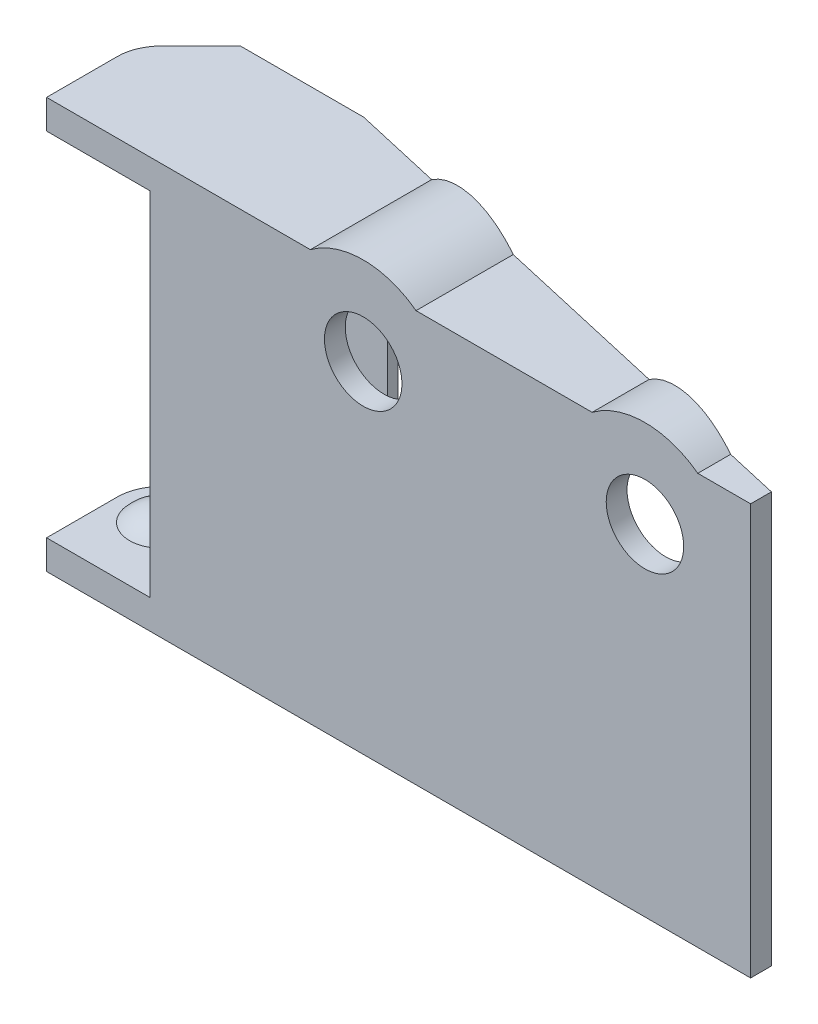
ISO-10303-21;
HEADER;
FILE_DESCRIPTION(('STEP AP214'),'2;1');
FILE_NAME('part.step','',(''),(''),'','','');
FILE_SCHEMA(('AUTOMOTIVE_DESIGN { 1 0 10303 214 1 1 1 1 }'));
ENDSEC;
DATA;
#1=APPLICATION_CONTEXT('core data for automotive mechanical design processes');
#2=APPLICATION_PROTOCOL_DEFINITION('international standard','automotive_design',2000,#1);
#3=PRODUCT_CONTEXT('',#1,'mechanical');
#4=PRODUCT('Part','Part','',(#3));
#5=PRODUCT_RELATED_PRODUCT_CATEGORY('part','',(#4));
#6=PRODUCT_DEFINITION_FORMATION('','',#4);
#7=PRODUCT_DEFINITION_CONTEXT('part definition',#1,'design');
#8=PRODUCT_DEFINITION('design','',#6,#7);
#9=PRODUCT_DEFINITION_SHAPE('','',#8);
#10=(LENGTH_UNIT() NAMED_UNIT(*) SI_UNIT(.MILLI.,.METRE.));
#11=(NAMED_UNIT(*) PLANE_ANGLE_UNIT() SI_UNIT($,.RADIAN.));
#12=(NAMED_UNIT(*) SI_UNIT($,.STERADIAN.) SOLID_ANGLE_UNIT());
#13=UNCERTAINTY_MEASURE_WITH_UNIT(LENGTH_MEASURE(1.E-05),#10,'distance_accuracy_value','');
#14=(GEOMETRIC_REPRESENTATION_CONTEXT(3) GLOBAL_UNCERTAINTY_ASSIGNED_CONTEXT((#13)) GLOBAL_UNIT_ASSIGNED_CONTEXT((#10,
#11,#12)) REPRESENTATION_CONTEXT('',''));
#15=CARTESIAN_POINT('',(0.,0.,0.));
#16=DIRECTION('',(0.,0.,1.));
#17=DIRECTION('',(1.,0.,0.));
#18=AXIS2_PLACEMENT_3D('',#15,#16,#17);
#19=CARTESIAN_POINT('',(-6.35,2.1082,-3.175));
#20=DIRECTION('',(0.,1.,0.));
#21=DIRECTION('',(0.,0.,1.));
#22=AXIS2_PLACEMENT_3D('',#19,#20,#21);
#23=PLANE('',#22);
#24=DIRECTION('',(1.,0.,0.));
#25=VECTOR('',#24,1.);
#26=CARTESIAN_POINT('',(-9.525,2.1082,1.92377963979501));
#27=LINE('',#26,#25);
#28=CARTESIAN_POINT('',(-9.525,2.1082,1.92377963979501));
#29=VERTEX_POINT('',#28);
#30=CARTESIAN_POINT('',(9.4996,2.1082,1.92377963979501));
#31=VERTEX_POINT('',#30);
#32=EDGE_CURVE('E63',#29,#31,#27,.T.);
#33=ORIENTED_EDGE('',*,*,#32,.T.);
#34=DIRECTION('',(0.,0.,1.));
#35=VECTOR('',#34,1.);
#36=CARTESIAN_POINT('',(9.4996,2.1082,-13.778905146089));
#37=LINE('',#36,#35);
#38=CARTESIAN_POINT('',(9.4996,2.1082,-6.82418642653));
#39=VERTEX_POINT('',#38);
#40=EDGE_CURVE('E241',#39,#31,#37,.T.);
#41=ORIENTED_EDGE('',*,*,#40,.F.);
#42=DIRECTION('',(-0.974919679603738,0.,-0.22255700016253));
#43=VECTOR('',#42,1.);
#44=CARTESIAN_POINT('',(3.1496,2.1082,-8.273779639795));
#45=LINE('',#44,#43);
#46=CARTESIAN_POINT('',(3.1496,2.1082,-8.273779639795));
#47=VERTEX_POINT('',#46);
#48=EDGE_CURVE('E41',#39,#47,#45,.T.);
#49=ORIENTED_EDGE('',*,*,#48,.T.);
#50=DIRECTION('',(-1.,0.,0.));
#51=VECTOR('',#50,1.);
#52=CARTESIAN_POINT('',(-5.74134842073958,2.1082,-8.273779639795));
#53=LINE('',#52,#51);
#54=CARTESIAN_POINT('',(-5.74134842073958,2.1082,-8.273779639795));
#55=VERTEX_POINT('',#54);
#56=EDGE_CURVE('E321',#47,#55,#53,.T.);
#57=ORIENTED_EDGE('',*,*,#56,.T.);
#58=DIRECTION('',(-0.707106781186546,0.,0.707106781186549));
#59=VECTOR('',#58,1.);
#60=CARTESIAN_POINT('',(-8.59506403026729,2.1082,-5.42006403026728));
#61=LINE('',#60,#59);
#62=CARTESIAN_POINT('',(-8.59506403026729,2.1082,-5.42006403026728));
#63=VERTEX_POINT('',#62);
#64=EDGE_CURVE('E322',#55,#63,#61,.T.);
#65=ORIENTED_EDGE('',*,*,#64,.T.);
#66=CARTESIAN_POINT('',(-6.35,2.1082,-3.175));
#67=DIRECTION('',(0.,1.,0.));
#68=DIRECTION('',(0.,0.,1.));
#69=AXIS2_PLACEMENT_3D('',#66,#67,#68);
#70=CIRCLE('',#69,3.175);
#71=CARTESIAN_POINT('',(-9.525,2.1082,-3.17499999999998));
#72=VERTEX_POINT('',#71);
#73=EDGE_CURVE('E336',#63,#72,#70,.T.);
#74=ORIENTED_EDGE('',*,*,#73,.T.);
#75=DIRECTION('',(0.,0.,1.));
#76=VECTOR('',#75,1.);
#77=CARTESIAN_POINT('',(-9.525,2.1082,-3.17499999999998));
#78=LINE('',#77,#76);
#79=EDGE_CURVE('E331',#72,#29,#78,.T.);
#80=ORIENTED_EDGE('',*,*,#79,.T.);
#81=EDGE_LOOP('',(#33,#41,#49,#57,#65,#74,#80));
#82=FACE_BOUND('',#81,.T.);
#83=ADVANCED_FACE('F37',(#82),#23,.T.);
#84=CARTESIAN_POINT('',(29.8196,2.1082,-2.185488144082));
#85=VERTEX_POINT('',#84);
#86=CARTESIAN_POINT('',(17.1196,2.1082,-5.084674570612));
#87=VERTEX_POINT('',#86);
#88=EDGE_CURVE('E239',#85,#87,#45,.T.);
#89=ORIENTED_EDGE('',*,*,#88,.T.);
#90=DIRECTION('',(0.,0.,1.));
#91=VECTOR('',#90,1.);
#92=CARTESIAN_POINT('',(17.1196,2.1082,-13.778905146089));
#93=LINE('',#92,#91);
#94=CARTESIAN_POINT('',(17.1196,2.1082,1.92377963979501));
#95=VERTEX_POINT('',#94);
#96=EDGE_CURVE('E55',#87,#95,#93,.T.);
#97=ORIENTED_EDGE('',*,*,#96,.T.);
#98=CARTESIAN_POINT('',(29.8196,2.1082,1.92377963979501));
#99=VERTEX_POINT('',#98);
#100=EDGE_CURVE('E327',#95,#99,#27,.T.);
#101=ORIENTED_EDGE('',*,*,#100,.T.);
#102=DIRECTION('',(0.,0.,1.));
#103=VECTOR('',#102,1.);
#104=CARTESIAN_POINT('',(29.8196,2.1082,-13.778905146089));
#105=LINE('',#104,#103);
#106=EDGE_CURVE('E260',#85,#99,#105,.T.);
#107=ORIENTED_EDGE('',*,*,#106,.F.);
#108=EDGE_LOOP('',(#89,#97,#101,#107));
#109=FACE_BOUND('',#108,.T.);
#110=ADVANCED_FACE('F606',(#109),#23,.T.);
#111=CARTESIAN_POINT('',(41.2496,2.1082,0.423779639795008));
#112=VERTEX_POINT('',#111);
#113=CARTESIAN_POINT('',(37.4396,2.1082,-0.445976288163997));
#114=VERTEX_POINT('',#113);
#115=EDGE_CURVE('E295',#112,#114,#45,.T.);
#116=ORIENTED_EDGE('',*,*,#115,.T.);
#117=DIRECTION('',(0.,0.,1.));
#118=VECTOR('',#117,1.);
#119=CARTESIAN_POINT('',(37.4396,2.1082,-13.778905146089));
#120=LINE('',#119,#118);
#121=CARTESIAN_POINT('',(37.4396,2.1082,1.92377963979501));
#122=VERTEX_POINT('',#121);
#123=EDGE_CURVE('E250',#114,#122,#120,.T.);
#124=ORIENTED_EDGE('',*,*,#123,.T.);
#125=CARTESIAN_POINT('',(41.2496,2.1082,1.92377963979501));
#126=VERTEX_POINT('',#125);
#127=EDGE_CURVE('E329',#122,#126,#27,.T.);
#128=ORIENTED_EDGE('',*,*,#127,.T.);
#129=DIRECTION('',(0.,0.,-1.));
#130=VECTOR('',#129,1.);
#131=CARTESIAN_POINT('',(41.2496,2.1082,0.423779639795008));
#132=LINE('',#131,#130);
#133=EDGE_CURVE('E240',#126,#112,#132,.T.);
#134=ORIENTED_EDGE('',*,*,#133,.T.);
#135=EDGE_LOOP('',(#116,#124,#128,#134));
#136=FACE_BOUND('',#135,.T.);
#137=ADVANCED_FACE('F608',(#136),#23,.T.);
#138=CARTESIAN_POINT('',(0.961889819897504,-0.9,-21.4562459645916));
#139=DIRECTION('',(0.,-1.,0.));
#140=DIRECTION('',(0.,0.,-1.));
#141=AXIS2_PLACEMENT_3D('',#138,#139,#140);
#142=PLANE('',#141);
#143=DIRECTION('',(-1.,0.,0.));
#144=VECTOR('',#143,1.);
#145=CARTESIAN_POINT('',(0.961889819897504,-0.9,0.423779639795008));
#146=LINE('',#145,#144);
#147=CARTESIAN_POINT('',(29.5539615518547,-0.899999999999999,0.423779639795008));
#148=VERTEX_POINT('',#147);
#149=CARTESIAN_POINT('',(17.3852384481453,-0.9,0.423779639795008));
#150=VERTEX_POINT('',#149);
#151=EDGE_CURVE('E356',#148,#150,#146,.T.);
#152=ORIENTED_EDGE('',*,*,#151,.T.);
#153=DIRECTION('',(0.,0.,1.));
#154=VECTOR('',#153,1.);
#155=CARTESIAN_POINT('',(17.3852384481453,-0.9,-8.27390463979501));
#156=LINE('',#155,#154);
#157=CARTESIAN_POINT('',(17.3852384481453,-0.899999999999998,-5.02403398925552));
#158=VERTEX_POINT('',#157);
#159=EDGE_CURVE('E269',#150,#158,#156,.F.);
#160=ORIENTED_EDGE('',*,*,#159,.T.);
#161=DIRECTION('',(-0.974919679603738,0.,-0.22255700016253));
#162=VECTOR('',#161,1.);
#163=CARTESIAN_POINT('',(3.1496,-0.899999999999998,-8.273779639795));
#164=LINE('',#163,#162);
#165=CARTESIAN_POINT('',(29.5539615518547,-0.899999999999998,-2.24612872543848));
#166=VERTEX_POINT('',#165);
#167=EDGE_CURVE('E513',#166,#158,#164,.T.);
#168=ORIENTED_EDGE('',*,*,#167,.F.);
#169=DIRECTION('',(0.,0.,1.));
#170=VECTOR('',#169,1.);
#171=CARTESIAN_POINT('',(29.5539615518547,-0.9,-8.27390463979501));
#172=LINE('',#171,#170);
#173=EDGE_CURVE('E275',#166,#148,#172,.T.);
#174=ORIENTED_EDGE('',*,*,#173,.T.);
#175=EDGE_LOOP('',(#152,#160,#168,#174));
#176=FACE_BOUND('',#175,.T.);
#177=ADVANCED_FACE('F588',(#176),#142,.T.);
#178=CARTESIAN_POINT('',(9.23396155185473,-0.899999999999998,-6.88482700788648));
#179=VERTEX_POINT('',#178);
#180=CARTESIAN_POINT('',(6.35000000000005,-0.9,-7.54318466030943));
#181=VERTEX_POINT('',#180);
#182=EDGE_CURVE('E511',#179,#181,#164,.T.);
#183=ORIENTED_EDGE('',*,*,#182,.F.);
#184=DIRECTION('',(0.,0.,1.));
#185=VECTOR('',#184,1.);
#186=CARTESIAN_POINT('',(9.23396155185473,-0.9,-8.27390463979501));
#187=LINE('',#186,#185);
#188=CARTESIAN_POINT('',(9.23396155185473,-0.9,0.423779639795008));
#189=VERTEX_POINT('',#188);
#190=EDGE_CURVE('E266',#179,#189,#187,.T.);
#191=ORIENTED_EDGE('',*,*,#190,.T.);
#192=CARTESIAN_POINT('',(-2.05060899272738,-0.9,0.423779639795008));
#193=VERTEX_POINT('',#192);
#194=EDGE_CURVE('E357',#189,#193,#146,.T.);
#195=ORIENTED_EDGE('',*,*,#194,.T.);
#196=CARTESIAN_POINT('',(-6.35,-0.9,-3.175));
#197=DIRECTION('',(0.,-1.,0.));
#198=DIRECTION('',(0.,0.,-1.));
#199=AXIS2_PLACEMENT_3D('',#196,#197,#198);
#200=CIRCLE('',#199,5.606779639795);
#201=CARTESIAN_POINT('',(-4.01795709429871,-0.9,-8.273779639795));
#202=VERTEX_POINT('',#201);
#203=EDGE_CURVE('E349',#202,#193,#200,.T.);
#204=ORIENTED_EDGE('',*,*,#203,.F.);
#205=DIRECTION('',(1.,0.,0.));
#206=VECTOR('',#205,1.);
#207=CARTESIAN_POINT('',(0.961889819897504,-0.9,-8.273779639795));
#208=LINE('',#207,#206);
#209=CARTESIAN_POINT('',(-0.743220360204995,-0.9,-8.273779639795));
#210=VERTEX_POINT('',#209);
#211=EDGE_CURVE('E345',#202,#210,#208,.T.);
#212=ORIENTED_EDGE('',*,*,#211,.T.);
#213=DIRECTION('',(0.,0.,-1.));
#214=VECTOR('',#213,1.);
#215=CARTESIAN_POINT('',(-0.743220360204995,-0.9,-8.27377963979501));
#216=LINE('',#215,#214);
#217=CARTESIAN_POINT('',(-0.743220360204995,-0.9,-6.773779639795));
#218=VERTEX_POINT('',#217);
#219=EDGE_CURVE('E370',#218,#210,#216,.T.);
#220=ORIENTED_EDGE('',*,*,#219,.F.);
#221=DIRECTION('',(-1.,0.,0.));
#222=VECTOR('',#221,1.);
#223=CARTESIAN_POINT('',(6.35000000000005,-0.9,-6.77377963979501));
#224=LINE('',#223,#222);
#225=CARTESIAN_POINT('',(6.35000000000005,-0.9,-6.77377963979501));
#226=VERTEX_POINT('',#225);
#227=EDGE_CURVE('E373',#226,#218,#224,.T.);
#228=ORIENTED_EDGE('',*,*,#227,.F.);
#229=DIRECTION('',(0.,0.,1.));
#230=VECTOR('',#229,1.);
#231=CARTESIAN_POINT('',(6.35000000000005,-0.9,-8.27377963979501));
#232=LINE('',#231,#230);
#233=EDGE_CURVE('E375',#181,#226,#232,.T.);
#234=ORIENTED_EDGE('',*,*,#233,.F.);
#235=EDGE_LOOP('',(#183,#191,#195,#204,#212,#220,#228,#234));
#236=FACE_BOUND('',#235,.T.);
#237=ADVANCED_FACE('F525',(#236),#142,.T.);
#238=CARTESIAN_POINT('',(41.2496,-0.899999999999998,0.423779639795008));
#239=VERTEX_POINT('',#238);
#240=CARTESIAN_POINT('',(37.7052384481453,-0.899999999999999,0.423779639795008));
#241=VERTEX_POINT('',#240);
#242=EDGE_CURVE('E353',#239,#241,#146,.T.);
#243=ORIENTED_EDGE('',*,*,#242,.T.);
#244=DIRECTION('',(0.,0.,1.));
#245=VECTOR('',#244,1.);
#246=CARTESIAN_POINT('',(37.7052384481453,-0.9,-8.27390463979501));
#247=LINE('',#246,#245);
#248=CARTESIAN_POINT('',(37.7052384481453,-0.899999999999998,-0.385335706807521));
#249=VERTEX_POINT('',#248);
#250=EDGE_CURVE('E278',#241,#249,#247,.F.);
#251=ORIENTED_EDGE('',*,*,#250,.T.);
#252=EDGE_CURVE('E507',#239,#249,#164,.T.);
#253=ORIENTED_EDGE('',*,*,#252,.F.);
#254=EDGE_LOOP('',(#243,#251,#253));
#255=FACE_BOUND('',#254,.T.);
#256=ADVANCED_FACE('F619',(#255),#142,.T.);
#257=CARTESIAN_POINT('',(0.961889819897504,-24.5,-21.4562459645916));
#258=DIRECTION('',(0.,1.,0.));
#259=DIRECTION('',(0.,0.,-1.));
#260=AXIS2_PLACEMENT_3D('',#257,#258,#259);
#261=PLANE('',#260);
#262=DIRECTION('',(0.974919679603738,0.,0.22255700016253));
#263=VECTOR('',#262,1.);
#264=CARTESIAN_POINT('',(3.1496,-24.5,-8.273779639795));
#265=LINE('',#264,#263);
#266=CARTESIAN_POINT('',(6.35000000000005,-24.5,-7.54318466030943));
#267=VERTEX_POINT('',#266);
#268=CARTESIAN_POINT('',(41.2496,-24.5,0.423779639795008));
#269=VERTEX_POINT('',#268);
#270=EDGE_CURVE('E501',#267,#269,#265,.T.);
#271=ORIENTED_EDGE('',*,*,#270,.F.);
#272=DIRECTION('',(0.,0.,1.));
#273=VECTOR('',#272,1.);
#274=CARTESIAN_POINT('',(6.35000000000005,-24.5,-8.27377963979501));
#275=LINE('',#274,#273);
#276=CARTESIAN_POINT('',(6.35000000000005,-24.5,-6.77377963979501));
#277=VERTEX_POINT('',#276);
#278=EDGE_CURVE('E491',#267,#277,#275,.T.);
#279=ORIENTED_EDGE('',*,*,#278,.T.);
#280=DIRECTION('',(-1.,0.,0.));
#281=VECTOR('',#280,1.);
#282=CARTESIAN_POINT('',(6.35000000000005,-24.5,-6.77377963979501));
#283=LINE('',#282,#281);
#284=CARTESIAN_POINT('',(-0.743220360204995,-24.5,-6.773779639795));
#285=VERTEX_POINT('',#284);
#286=EDGE_CURVE('E489',#277,#285,#283,.T.);
#287=ORIENTED_EDGE('',*,*,#286,.T.);
#288=DIRECTION('',(0.,0.,-1.));
#289=VECTOR('',#288,1.);
#290=CARTESIAN_POINT('',(-0.743220360204995,-24.5,-8.27377963979501));
#291=LINE('',#290,#289);
#292=CARTESIAN_POINT('',(-0.743220360204995,-24.5,-8.273779639795));
#293=VERTEX_POINT('',#292);
#294=EDGE_CURVE('E487',#285,#293,#291,.T.);
#295=ORIENTED_EDGE('',*,*,#294,.T.);
#296=DIRECTION('',(1.,0.,0.));
#297=VECTOR('',#296,1.);
#298=CARTESIAN_POINT('',(0.961889819897504,-24.5,-8.273779639795));
#299=LINE('',#298,#297);
#300=CARTESIAN_POINT('',(-4.01795709429871,-24.5,-8.273779639795));
#301=VERTEX_POINT('',#300);
#302=EDGE_CURVE('E392',#301,#293,#299,.T.);
#303=ORIENTED_EDGE('',*,*,#302,.F.);
#304=CARTESIAN_POINT('',(-6.35,-24.5,-3.175));
#305=DIRECTION('',(0.,-1.,0.));
#306=DIRECTION('',(0.,0.,-1.));
#307=AXIS2_PLACEMENT_3D('',#304,#305,#306);
#308=CIRCLE('',#307,5.606779639795);
#309=CARTESIAN_POINT('',(-2.05060899272738,-24.5,0.423779639795008));
#310=VERTEX_POINT('',#309);
#311=EDGE_CURVE('E431',#301,#310,#308,.T.);
#312=ORIENTED_EDGE('',*,*,#311,.T.);
#313=DIRECTION('',(-1.,0.,0.));
#314=VECTOR('',#313,1.);
#315=CARTESIAN_POINT('',(0.961889819897504,-24.5,0.423779639795008));
#316=LINE('',#315,#314);
#317=EDGE_CURVE('E386',#269,#310,#316,.T.);
#318=ORIENTED_EDGE('',*,*,#317,.F.);
#319=EDGE_LOOP('',(#271,#279,#287,#295,#303,#312,#318));
#320=FACE_BOUND('',#319,.T.);
#321=ADVANCED_FACE('F482',(#320),#261,.T.);
#322=CARTESIAN_POINT('',(-6.35,2.1082,-3.175));
#323=DIRECTION('',(0.,-1.,0.));
#324=DIRECTION('',(0.,0.,-1.));
#325=AXIS2_PLACEMENT_3D('',#322,#323,#324);
#326=CYLINDRICAL_SURFACE('',#325,3.175);
#327=CARTESIAN_POINT('',(-6.35,0.,-3.175));
#328=DIRECTION('',(0.,1.,0.));
#329=DIRECTION('',(0.,0.,1.));
#330=AXIS2_PLACEMENT_3D('',#327,#328,#329);
#331=CIRCLE('',#330,3.175);
#332=CARTESIAN_POINT('',(-8.59506403026729,0.,-5.42006403026728));
#333=VERTEX_POINT('',#332);
#334=CARTESIAN_POINT('',(-9.525,0.,-3.17499999999998));
#335=VERTEX_POINT('',#334);
#336=EDGE_CURVE('E555',#333,#335,#331,.T.);
#337=ORIENTED_EDGE('',*,*,#336,.T.);
#338=DIRECTION('',(0.,-1.,0.));
#339=VECTOR('',#338,1.);
#340=CARTESIAN_POINT('',(-9.525,2.1082,-3.17499999999998));
#341=LINE('',#340,#339);
#342=EDGE_CURVE('E309',#72,#335,#341,.T.);
#343=ORIENTED_EDGE('',*,*,#342,.F.);
#344=ORIENTED_EDGE('',*,*,#73,.F.);
#345=DIRECTION('',(0.,-1.,0.));
#346=VECTOR('',#345,1.);
#347=CARTESIAN_POINT('',(-8.59506403026729,2.1082,-5.42006403026728));
#348=LINE('',#347,#346);
#349=EDGE_CURVE('E325',#63,#333,#348,.T.);
#350=ORIENTED_EDGE('',*,*,#349,.T.);
#351=EDGE_LOOP('',(#337,#343,#344,#350));
#352=FACE_BOUND('',#351,.T.);
#353=ADVANCED_FACE('F39',(#352),#326,.T.);
#354=CARTESIAN_POINT('',(-9.525,2.1082,-3.17499999999998));
#355=DIRECTION('',(1.,0.,0.));
#356=DIRECTION('',(0.,0.,-1.));
#357=AXIS2_PLACEMENT_3D('',#354,#355,#356);
#358=PLANE('',#357);
#359=DIRECTION('',(0.,0.,1.));
#360=VECTOR('',#359,1.);
#361=CARTESIAN_POINT('',(-9.525,0.,-3.17499999999998));
#362=LINE('',#361,#360);
#363=CARTESIAN_POINT('',(-9.525,0.,1.92377963979501));
#364=VERTEX_POINT('',#363);
#365=EDGE_CURVE('E560',#335,#364,#362,.T.);
#366=ORIENTED_EDGE('',*,*,#365,.T.);
#367=DIRECTION('',(0.,-1.,0.));
#368=VECTOR('',#367,1.);
#369=CARTESIAN_POINT('',(-9.525,2.1082,1.92377963979501));
#370=LINE('',#369,#368);
#371=EDGE_CURVE('E314',#29,#364,#370,.T.);
#372=ORIENTED_EDGE('',*,*,#371,.F.);
#373=ORIENTED_EDGE('',*,*,#79,.F.);
#374=ORIENTED_EDGE('',*,*,#342,.T.);
#375=EDGE_LOOP('',(#366,#372,#373,#374));
#376=FACE_BOUND('',#375,.T.);
#377=ADVANCED_FACE('F626',(#376),#358,.F.);
#378=CARTESIAN_POINT('',(-6.98990972304999,2.1082,1.92377963979501));
#379=DIRECTION('',(0.,0.,-1.));
#380=DIRECTION('',(-1.,0.,0.));
#381=AXIS2_PLACEMENT_3D('',#378,#379,#380);
#382=PLANE('',#381);
#383=CARTESIAN_POINT('',(13.3096,-2.9718,1.923779639795));
#384=DIRECTION('',(0.,0.,-1.));
#385=DIRECTION('',(-1.,0.,0.));
#386=AXIS2_PLACEMENT_3D('',#383,#384,#385);
#387=CIRCLE('',#386,2.794);
#388=CARTESIAN_POINT('',(10.5156,-2.9718,1.92377963979501));
#389=VERTEX_POINT('',#388);
#390=EDGE_CURVE('E281',#389,#389,#387,.F.);
#391=ORIENTED_EDGE('',*,*,#390,.F.);
#392=EDGE_LOOP('',(#391));
#393=FACE_BOUND('',#392,.T.);
#394=CARTESIAN_POINT('',(33.6296,-2.9718,1.923779639795));
#395=DIRECTION('',(0.,0.,-1.));
#396=DIRECTION('',(-1.,0.,0.));
#397=AXIS2_PLACEMENT_3D('',#394,#395,#396);
#398=CIRCLE('',#397,2.794);
#399=CARTESIAN_POINT('',(30.8356,-2.9718,1.923779639795));
#400=VERTEX_POINT('',#399);
#401=EDGE_CURVE('E284',#400,#400,#398,.F.);
#402=ORIENTED_EDGE('',*,*,#401,.F.);
#403=EDGE_LOOP('',(#402));
#404=FACE_BOUND('',#403,.T.);
#405=DIRECTION('',(0.,-1.,0.));
#406=VECTOR('',#405,1.);
#407=CARTESIAN_POINT('',(41.2496,-0.9,1.92377963979501));
#408=LINE('',#407,#406);
#409=CARTESIAN_POINT('',(41.2496,-27.5082,1.92377963979501));
#410=VERTEX_POINT('',#409);
#411=EDGE_CURVE('E493',#126,#410,#408,.T.);
#412=ORIENTED_EDGE('',*,*,#411,.F.);
#413=ORIENTED_EDGE('',*,*,#127,.F.);
#414=CARTESIAN_POINT('',(33.6296,-2.9718,1.923779639795));
#415=DIRECTION('',(0.,0.,-1.));
#416=DIRECTION('',(-1.,0.,0.));
#417=AXIS2_PLACEMENT_3D('',#414,#415,#416);
#418=CIRCLE('',#417,6.35);
#419=EDGE_CURVE('E247',#122,#99,#418,.F.);
#420=ORIENTED_EDGE('',*,*,#419,.T.);
#421=ORIENTED_EDGE('',*,*,#100,.F.);
#422=CARTESIAN_POINT('',(13.3096,-2.9718,1.923779639795));
#423=DIRECTION('',(0.,0.,-1.));
#424=DIRECTION('',(-1.,0.,0.));
#425=AXIS2_PLACEMENT_3D('',#422,#423,#424);
#426=CIRCLE('',#425,6.35);
#427=EDGE_CURVE('E253',#95,#31,#426,.F.);
#428=ORIENTED_EDGE('',*,*,#427,.T.);
#429=ORIENTED_EDGE('',*,*,#32,.F.);
#430=ORIENTED_EDGE('',*,*,#371,.T.);
#431=DIRECTION('',(1.,0.,0.));
#432=VECTOR('',#431,1.);
#433=CARTESIAN_POINT('',(-6.98990972304999,0.,1.92377963979501));
#434=LINE('',#433,#432);
#435=CARTESIAN_POINT('',(-2.05060899272738,0.,1.92377963979501));
#436=VERTEX_POINT('',#435);
#437=EDGE_CURVE('E473',#364,#436,#434,.T.);
#438=ORIENTED_EDGE('',*,*,#437,.T.);
#439=DIRECTION('',(0.,1.,0.));
#440=VECTOR('',#439,1.);
#441=CARTESIAN_POINT('',(-2.05060899272738,-0.9,1.92377963979501));
#442=LINE('',#441,#440);
#443=CARTESIAN_POINT('',(-2.05060899272738,-25.4,1.92377963979501));
#444=VERTEX_POINT('',#443);
#445=EDGE_CURVE('E344',#444,#436,#442,.T.);
#446=ORIENTED_EDGE('',*,*,#445,.F.);
#447=DIRECTION('',(1.,0.,0.));
#448=VECTOR('',#447,1.);
#449=CARTESIAN_POINT('',(-6.98990972304999,-25.4,1.92377963979501));
#450=LINE('',#449,#448);
#451=CARTESIAN_POINT('',(-9.525,-25.4,1.92377963979501));
#452=VERTEX_POINT('',#451);
#453=EDGE_CURVE('E418',#452,#444,#450,.T.);
#454=ORIENTED_EDGE('',*,*,#453,.F.);
#455=DIRECTION('',(0.,1.,0.));
#456=VECTOR('',#455,1.);
#457=CARTESIAN_POINT('',(-9.525,-27.5082,1.92377963979501));
#458=LINE('',#457,#456);
#459=CARTESIAN_POINT('',(-9.525,-27.5082,1.92377963979501));
#460=VERTEX_POINT('',#459);
#461=EDGE_CURVE('E453',#460,#452,#458,.T.);
#462=ORIENTED_EDGE('',*,*,#461,.F.);
#463=DIRECTION('',(1.,0.,0.));
#464=VECTOR('',#463,1.);
#465=CARTESIAN_POINT('',(-9.525,-27.5082,1.92377963979501));
#466=LINE('',#465,#464);
#467=EDGE_CURVE('E404',#460,#410,#466,.T.);
#468=ORIENTED_EDGE('',*,*,#467,.T.);
#469=EDGE_LOOP('',(#412,#413,#420,#421,#428,#429,#430,#438,#446,#454,#462,#468));
#470=FACE_BOUND('',#469,.T.);
#471=ADVANCED_FACE('F467',(#393,#404,#470),#382,.F.);
#472=CARTESIAN_POINT('',(-5.74134842073958,2.1082,-8.273779639795));
#473=DIRECTION('',(0.,0.,1.));
#474=DIRECTION('',(1.,0.,0.));
#475=AXIS2_PLACEMENT_3D('',#472,#473,#474);
#476=PLANE('',#475);
#477=DIRECTION('',(0.,-1.,0.));
#478=VECTOR('',#477,1.);
#479=CARTESIAN_POINT('',(3.1496,2.1082,-8.273779639795));
#480=LINE('',#479,#478);
#481=CARTESIAN_POINT('',(3.1496,-27.5082,-8.273779639795));
#482=VERTEX_POINT('',#481);
#483=EDGE_CURVE('E237',#47,#482,#480,.T.);
#484=ORIENTED_EDGE('',*,*,#483,.T.);
#485=DIRECTION('',(-1.,0.,0.));
#486=VECTOR('',#485,1.);
#487=CARTESIAN_POINT('',(-5.74134842073958,-27.5082,-8.273779639795));
#488=LINE('',#487,#486);
#489=CARTESIAN_POINT('',(-5.74134842073958,-27.5082,-8.273779639795));
#490=VERTEX_POINT('',#489);
#491=EDGE_CURVE('E406',#482,#490,#488,.T.);
#492=ORIENTED_EDGE('',*,*,#491,.T.);
#493=DIRECTION('',(0.,1.,0.));
#494=VECTOR('',#493,1.);
#495=CARTESIAN_POINT('',(-5.74134842073958,-27.5082,-8.273779639795));
#496=LINE('',#495,#494);
#497=CARTESIAN_POINT('',(-5.74134842073958,-25.4,-8.273779639795));
#498=VERTEX_POINT('',#497);
#499=EDGE_CURVE('E447',#490,#498,#496,.T.);
#500=ORIENTED_EDGE('',*,*,#499,.T.);
#501=DIRECTION('',(-1.,0.,0.));
#502=VECTOR('',#501,1.);
#503=CARTESIAN_POINT('',(-5.74134842073958,-25.4,-8.273779639795));
#504=LINE('',#503,#502);
#505=CARTESIAN_POINT('',(-4.01795709429871,-25.4,-8.273779639795));
#506=VERTEX_POINT('',#505);
#507=EDGE_CURVE('E427',#506,#498,#504,.T.);
#508=ORIENTED_EDGE('',*,*,#507,.F.);
#509=DIRECTION('',(0.,-1.,0.));
#510=VECTOR('',#509,1.);
#511=CARTESIAN_POINT('',(-4.01795709429871,-24.5,-8.273779639795));
#512=LINE('',#511,#510);
#513=EDGE_CURVE('E396',#301,#506,#512,.T.);
#514=ORIENTED_EDGE('',*,*,#513,.F.);
#515=ORIENTED_EDGE('',*,*,#302,.T.);
#516=DIRECTION('',(0.,1.,0.));
#517=VECTOR('',#516,1.);
#518=CARTESIAN_POINT('',(-0.743220360204995,-12.7,-8.27377963979501));
#519=LINE('',#518,#517);
#520=EDGE_CURVE('E367',#293,#210,#519,.T.);
#521=ORIENTED_EDGE('',*,*,#520,.T.);
#522=ORIENTED_EDGE('',*,*,#211,.F.);
#523=DIRECTION('',(0.,1.,0.));
#524=VECTOR('',#523,1.);
#525=CARTESIAN_POINT('',(-4.01795709429871,-0.9,-8.273779639795));
#526=LINE('',#525,#524);
#527=CARTESIAN_POINT('',(-4.01795709429871,0.,-8.273779639795));
#528=VERTEX_POINT('',#527);
#529=EDGE_CURVE('E476',#202,#528,#526,.T.);
#530=ORIENTED_EDGE('',*,*,#529,.T.);
#531=DIRECTION('',(-1.,0.,0.));
#532=VECTOR('',#531,1.);
#533=CARTESIAN_POINT('',(-5.74134842073958,0.,-8.273779639795));
#534=LINE('',#533,#532);
#535=CARTESIAN_POINT('',(-5.74134842073958,0.,-8.273779639795));
#536=VERTEX_POINT('',#535);
#537=EDGE_CURVE('E576',#528,#536,#534,.T.);
#538=ORIENTED_EDGE('',*,*,#537,.T.);
#539=DIRECTION('',(0.,-1.,0.));
#540=VECTOR('',#539,1.);
#541=CARTESIAN_POINT('',(-5.74134842073958,2.1082,-8.273779639795));
#542=LINE('',#541,#540);
#543=EDGE_CURVE('E544',#55,#536,#542,.T.);
#544=ORIENTED_EDGE('',*,*,#543,.F.);
#545=ORIENTED_EDGE('',*,*,#56,.F.);
#546=EDGE_LOOP('',(#484,#492,#500,#508,#514,#515,#521,#522,#530,#538,#544,#545));
#547=FACE_BOUND('',#546,.T.);
#548=ADVANCED_FACE('F445',(#547),#476,.F.);
#549=CARTESIAN_POINT('',(-8.59506403026729,2.1082,-5.42006403026728));
#550=DIRECTION('',(0.707106781186549,0.,0.707106781186546));
#551=DIRECTION('',(0.707106781186546,0.,-0.707106781186549));
#552=AXIS2_PLACEMENT_3D('',#549,#550,#551);
#553=PLANE('',#552);
#554=DIRECTION('',(-0.707106781186546,0.,0.707106781186549));
#555=VECTOR('',#554,1.);
#556=CARTESIAN_POINT('',(-8.59506403026729,0.,-5.42006403026728));
#557=LINE('',#556,#555);
#558=EDGE_CURVE('E339',#536,#333,#557,.T.);
#559=ORIENTED_EDGE('',*,*,#558,.T.);
#560=ORIENTED_EDGE('',*,*,#349,.F.);
#561=ORIENTED_EDGE('',*,*,#64,.F.);
#562=ORIENTED_EDGE('',*,*,#543,.T.);
#563=EDGE_LOOP('',(#559,#560,#561,#562));
#564=FACE_BOUND('',#563,.T.);
#565=ADVANCED_FACE('F632',(#564),#553,.F.);
#566=CARTESIAN_POINT('',(-6.35,0.,-3.175));
#567=DIRECTION('',(0.,1.,0.));
#568=DIRECTION('',(0.,0.,1.));
#569=AXIS2_PLACEMENT_3D('',#566,#567,#568);
#570=PLANE('',#569);
#571=CARTESIAN_POINT('',(-6.35,0.,-3.175));
#572=DIRECTION('',(0.,1.,0.));
#573=DIRECTION('',(0.,0.,1.));
#574=AXIS2_PLACEMENT_3D('',#571,#572,#573);
#575=CIRCLE('',#574,2.286);
#576=CARTESIAN_POINT('',(-6.35,0.,-0.888999999999999));
#577=VERTEX_POINT('',#576);
#578=EDGE_CURVE('E305',#577,#577,#575,.F.);
#579=ORIENTED_EDGE('',*,*,#578,.F.);
#580=EDGE_LOOP('',(#579));
#581=FACE_BOUND('',#580,.T.);
#582=ORIENTED_EDGE('',*,*,#537,.F.);
#583=CARTESIAN_POINT('',(-6.35,0.,-3.175));
#584=DIRECTION('',(0.,-1.,0.));
#585=DIRECTION('',(0.,0.,-1.));
#586=AXIS2_PLACEMENT_3D('',#583,#584,#585);
#587=CIRCLE('',#586,5.606779639795);
#588=CARTESIAN_POINT('',(-2.05060899272738,0.,0.423779639795008));
#589=VERTEX_POINT('',#588);
#590=EDGE_CURVE('E318',#528,#589,#587,.T.);
#591=ORIENTED_EDGE('',*,*,#590,.T.);
#592=DIRECTION('',(0.,0.,-1.));
#593=VECTOR('',#592,1.);
#594=CARTESIAN_POINT('',(-2.05060899272738,0.,-21.4562459645916));
#595=LINE('',#594,#593);
#596=EDGE_CURVE('E352',#436,#589,#595,.T.);
#597=ORIENTED_EDGE('',*,*,#596,.F.);
#598=ORIENTED_EDGE('',*,*,#437,.F.);
#599=ORIENTED_EDGE('',*,*,#365,.F.);
#600=ORIENTED_EDGE('',*,*,#336,.F.);
#601=ORIENTED_EDGE('',*,*,#558,.F.);
#602=EDGE_LOOP('',(#582,#591,#597,#598,#599,#600,#601));
#603=FACE_BOUND('',#602,.T.);
#604=ADVANCED_FACE('F580',(#581,#603),#570,.F.);
#605=CARTESIAN_POINT('',(-6.35,-0.9,-3.175));
#606=DIRECTION('',(0.,1.,0.));
#607=DIRECTION('',(0.,0.,1.));
#608=AXIS2_PLACEMENT_3D('',#605,#606,#607);
#609=CYLINDRICAL_SURFACE('',#608,5.606779639795);
#610=ORIENTED_EDGE('',*,*,#590,.F.);
#611=ORIENTED_EDGE('',*,*,#529,.F.);
#612=ORIENTED_EDGE('',*,*,#203,.T.);
#613=DIRECTION('',(0.,1.,0.));
#614=VECTOR('',#613,1.);
#615=CARTESIAN_POINT('',(-2.05060899272738,-0.9,0.423779639795008));
#616=LINE('',#615,#614);
#617=EDGE_CURVE('E342',#193,#589,#616,.T.);
#618=ORIENTED_EDGE('',*,*,#617,.T.);
#619=EDGE_LOOP('',(#610,#611,#612,#618));
#620=FACE_BOUND('',#619,.T.);
#621=ADVANCED_FACE('F583',(#620),#609,.F.);
#622=CARTESIAN_POINT('',(-2.05060899272738,-0.9,-21.4562459645916));
#623=DIRECTION('',(1.,0.,0.));
#624=DIRECTION('',(0.,0.,-1.));
#625=AXIS2_PLACEMENT_3D('',#622,#623,#624);
#626=PLANE('',#625);
#627=ORIENTED_EDGE('',*,*,#596,.T.);
#628=ORIENTED_EDGE('',*,*,#617,.F.);
#629=DIRECTION('',(0.,1.,0.));
#630=VECTOR('',#629,1.);
#631=CARTESIAN_POINT('',(-2.05060899272738,-12.7,0.423779639795008));
#632=LINE('',#631,#630);
#633=EDGE_CURVE('E358',#310,#193,#632,.T.);
#634=ORIENTED_EDGE('',*,*,#633,.F.);
#635=DIRECTION('',(0.,-1.,0.));
#636=VECTOR('',#635,1.);
#637=CARTESIAN_POINT('',(-2.05060899272738,-24.5,0.423779639795008));
#638=LINE('',#637,#636);
#639=CARTESIAN_POINT('',(-2.05060899272738,-25.4,0.423779639795008));
#640=VERTEX_POINT('',#639);
#641=EDGE_CURVE('E394',#310,#640,#638,.T.);
#642=ORIENTED_EDGE('',*,*,#641,.T.);
#643=DIRECTION('',(0.,0.,-1.));
#644=VECTOR('',#643,1.);
#645=CARTESIAN_POINT('',(-2.05060899272738,-25.4,-21.4562459645916));
#646=LINE('',#645,#644);
#647=EDGE_CURVE('E385',#444,#640,#646,.T.);
#648=ORIENTED_EDGE('',*,*,#647,.F.);
#649=ORIENTED_EDGE('',*,*,#445,.T.);
#650=EDGE_LOOP('',(#627,#628,#634,#642,#648,#649));
#651=FACE_BOUND('',#650,.T.);
#652=ADVANCED_FACE('F478',(#651),#626,.F.);
#653=CARTESIAN_POINT('',(-6.35,1.91818175687129,-3.175));
#654=DIRECTION('',(0.,1.,0.));
#655=DIRECTION('',(-1.,0.,0.));
#656=AXIS2_PLACEMENT_3D('',#653,#654,#655);
#657=SPHERICAL_SURFACE('',#656,2.9841610634136);
#658=ORIENTED_EDGE('',*,*,#578,.T.);
#659=EDGE_LOOP('',(#658));
#660=FACE_BOUND('',#659,.T.);
#661=ADVANCED_FACE('F685',(#660),#657,.T.);
#662=CARTESIAN_POINT('',(-2.05060899272738,-12.7,0.423779639795008));
#663=DIRECTION('',(0.,0.,1.));
#664=DIRECTION('',(1.,0.,0.));
#665=AXIS2_PLACEMENT_3D('',#662,#663,#664);
#666=PLANE('',#665);
#667=ORIENTED_EDGE('',*,*,#194,.F.);
#668=CARTESIAN_POINT('',(13.3096,-2.9718,0.423779639795008));
#669=DIRECTION('',(0.,0.,-1.));
#670=DIRECTION('',(-1.,0.,0.));
#671=AXIS2_PLACEMENT_3D('',#668,#669,#670);
#672=CIRCLE('',#671,4.572);
#673=EDGE_CURVE('E259',#189,#150,#672,.T.);
#674=ORIENTED_EDGE('',*,*,#673,.T.);
#675=ORIENTED_EDGE('',*,*,#151,.F.);
#676=CARTESIAN_POINT('',(33.6296,-2.9718,0.423779639795008));
#677=DIRECTION('',(0.,0.,-1.));
#678=DIRECTION('',(-1.,0.,0.));
#679=AXIS2_PLACEMENT_3D('',#676,#677,#678);
#680=CIRCLE('',#679,4.572);
#681=EDGE_CURVE('E272',#148,#241,#680,.T.);
#682=ORIENTED_EDGE('',*,*,#681,.T.);
#683=ORIENTED_EDGE('',*,*,#242,.F.);
#684=DIRECTION('',(0.,1.,0.));
#685=VECTOR('',#684,1.);
#686=CARTESIAN_POINT('',(41.2496,-24.5,0.423779639795008));
#687=LINE('',#686,#685);
#688=EDGE_CURVE('E495',#269,#239,#687,.T.);
#689=ORIENTED_EDGE('',*,*,#688,.F.);
#690=ORIENTED_EDGE('',*,*,#317,.T.);
#691=ORIENTED_EDGE('',*,*,#633,.T.);
#692=EDGE_LOOP('',(#667,#674,#675,#682,#683,#689,#690,#691));
#693=FACE_BOUND('',#692,.T.);
#694=CARTESIAN_POINT('',(13.3096,-2.9718,0.423779639795008));
#695=DIRECTION('',(0.,0.,1.));
#696=DIRECTION('',(1.,0.,0.));
#697=AXIS2_PLACEMENT_3D('',#694,#695,#696);
#698=CIRCLE('',#697,2.794);
#699=CARTESIAN_POINT('',(16.1036,-2.9718,0.423779639795008));
#700=VERTEX_POINT('',#699);
#701=EDGE_CURVE('E301',#700,#700,#698,.T.);
#702=ORIENTED_EDGE('',*,*,#701,.T.);
#703=EDGE_LOOP('',(#702));
#704=FACE_BOUND('',#703,.T.);
#705=CARTESIAN_POINT('',(33.6296,-2.9718,0.423779639795008));
#706=DIRECTION('',(0.,0.,1.));
#707=DIRECTION('',(1.,0.,0.));
#708=AXIS2_PLACEMENT_3D('',#705,#706,#707);
#709=CIRCLE('',#708,2.794);
#710=CARTESIAN_POINT('',(36.4236,-2.9718,0.423779639795008));
#711=VERTEX_POINT('',#710);
#712=EDGE_CURVE('E303',#711,#711,#709,.T.);
#713=ORIENTED_EDGE('',*,*,#712,.T.);
#714=EDGE_LOOP('',(#713));
#715=FACE_BOUND('',#714,.T.);
#716=ADVANCED_FACE('F536',(#693,#704,#715),#666,.F.);
#717=CARTESIAN_POINT('',(6.35000000000005,-12.7,-8.27377963979501));
#718=DIRECTION('',(-1.,0.,0.));
#719=DIRECTION('',(0.,0.,1.));
#720=AXIS2_PLACEMENT_3D('',#717,#718,#719);
#721=PLANE('',#720);
#722=ORIENTED_EDGE('',*,*,#278,.F.);
#723=DIRECTION('',(0.,1.,0.));
#724=VECTOR('',#723,1.);
#725=CARTESIAN_POINT('',(6.35000000000005,-12.7,-7.54318466030943));
#726=LINE('',#725,#724);
#727=EDGE_CURVE('E287',#267,#181,#726,.T.);
#728=ORIENTED_EDGE('',*,*,#727,.T.);
#729=ORIENTED_EDGE('',*,*,#233,.T.);
#730=DIRECTION('',(0.,1.,0.));
#731=VECTOR('',#730,1.);
#732=CARTESIAN_POINT('',(6.35000000000005,-12.7,-6.77377963979501));
#733=LINE('',#732,#731);
#734=EDGE_CURVE('E361',#277,#226,#733,.T.);
#735=ORIENTED_EDGE('',*,*,#734,.F.);
#736=EDGE_LOOP('',(#722,#728,#729,#735));
#737=FACE_BOUND('',#736,.T.);
#738=ADVANCED_FACE('F522',(#737),#721,.F.);
#739=CARTESIAN_POINT('',(6.35000000000005,-12.7,-6.77377963979501));
#740=DIRECTION('',(0.,0.,-1.));
#741=DIRECTION('',(-1.,0.,0.));
#742=AXIS2_PLACEMENT_3D('',#739,#740,#741);
#743=PLANE('',#742);
#744=ORIENTED_EDGE('',*,*,#227,.T.);
#745=DIRECTION('',(0.,1.,0.));
#746=VECTOR('',#745,1.);
#747=CARTESIAN_POINT('',(-0.743220360204995,-12.7,-6.773779639795));
#748=LINE('',#747,#746);
#749=EDGE_CURVE('E364',#285,#218,#748,.T.);
#750=ORIENTED_EDGE('',*,*,#749,.F.);
#751=ORIENTED_EDGE('',*,*,#286,.F.);
#752=ORIENTED_EDGE('',*,*,#734,.T.);
#753=EDGE_LOOP('',(#744,#750,#751,#752));
#754=FACE_BOUND('',#753,.T.);
#755=ADVANCED_FACE('F530',(#754),#743,.F.);
#756=CARTESIAN_POINT('',(-0.743220360204995,-12.7,-8.27377963979501));
#757=DIRECTION('',(1.,0.,0.));
#758=DIRECTION('',(0.,0.,-1.));
#759=AXIS2_PLACEMENT_3D('',#756,#757,#758);
#760=PLANE('',#759);
#761=ORIENTED_EDGE('',*,*,#219,.T.);
#762=ORIENTED_EDGE('',*,*,#520,.F.);
#763=ORIENTED_EDGE('',*,*,#294,.F.);
#764=ORIENTED_EDGE('',*,*,#749,.T.);
#765=EDGE_LOOP('',(#761,#762,#763,#764));
#766=FACE_BOUND('',#765,.T.);
#767=ADVANCED_FACE('F675',(#766),#760,.F.);
#768=CARTESIAN_POINT('',(-6.35,-27.5082,-3.175));
#769=DIRECTION('',(0.,1.,0.));
#770=DIRECTION('',(0.,0.,-1.));
#771=AXIS2_PLACEMENT_3D('',#768,#769,#770);
#772=CYLINDRICAL_SURFACE('',#771,3.175);
#773=CARTESIAN_POINT('',(-6.35,-25.4,-3.175));
#774=DIRECTION('',(0.,1.,0.));
#775=DIRECTION('',(0.,0.,1.));
#776=AXIS2_PLACEMENT_3D('',#773,#774,#775);
#777=CIRCLE('',#776,3.175);
#778=CARTESIAN_POINT('',(-8.59506403026729,-25.4,-5.42006403026728));
#779=VERTEX_POINT('',#778);
#780=CARTESIAN_POINT('',(-9.525,-25.4,-3.17499999999998));
#781=VERTEX_POINT('',#780);
#782=EDGE_CURVE('E412',#779,#781,#777,.T.);
#783=ORIENTED_EDGE('',*,*,#782,.F.);
#784=DIRECTION('',(0.,1.,0.));
#785=VECTOR('',#784,1.);
#786=CARTESIAN_POINT('',(-8.59506403026729,-27.5082,-5.42006403026728));
#787=LINE('',#786,#785);
#788=CARTESIAN_POINT('',(-8.59506403026729,-27.5082,-5.42006403026728));
#789=VERTEX_POINT('',#788);
#790=EDGE_CURVE('E411',#789,#779,#787,.T.);
#791=ORIENTED_EDGE('',*,*,#790,.F.);
#792=CARTESIAN_POINT('',(-6.35,-27.5082,-3.175));
#793=DIRECTION('',(0.,1.,0.));
#794=DIRECTION('',(0.,0.,1.));
#795=AXIS2_PLACEMENT_3D('',#792,#793,#794);
#796=CIRCLE('',#795,3.175);
#797=CARTESIAN_POINT('',(-9.525,-27.5082,-3.17499999999998));
#798=VERTEX_POINT('',#797);
#799=EDGE_CURVE('E397',#789,#798,#796,.T.);
#800=ORIENTED_EDGE('',*,*,#799,.T.);
#801=DIRECTION('',(0.,1.,0.));
#802=VECTOR('',#801,1.);
#803=CARTESIAN_POINT('',(-9.525,-27.5082,-3.17499999999998));
#804=LINE('',#803,#802);
#805=EDGE_CURVE('E380',#798,#781,#804,.T.);
#806=ORIENTED_EDGE('',*,*,#805,.T.);
#807=EDGE_LOOP('',(#783,#791,#800,#806));
#808=FACE_BOUND('',#807,.T.);
#809=ADVANCED_FACE('F459',(#808),#772,.T.);
#810=CARTESIAN_POINT('',(-9.525,-27.5082,-3.17499999999998));
#811=DIRECTION('',(1.,0.,0.));
#812=DIRECTION('',(0.,0.,-1.));
#813=AXIS2_PLACEMENT_3D('',#810,#811,#812);
#814=PLANE('',#813);
#815=DIRECTION('',(0.,0.,1.));
#816=VECTOR('',#815,1.);
#817=CARTESIAN_POINT('',(-9.525,-25.4,-3.17499999999998));
#818=LINE('',#817,#816);
#819=EDGE_CURVE('E415',#781,#452,#818,.T.);
#820=ORIENTED_EDGE('',*,*,#819,.F.);
#821=ORIENTED_EDGE('',*,*,#805,.F.);
#822=DIRECTION('',(0.,0.,1.));
#823=VECTOR('',#822,1.);
#824=CARTESIAN_POINT('',(-9.525,-27.5082,-3.17499999999998));
#825=LINE('',#824,#823);
#826=EDGE_CURVE('E400',#798,#460,#825,.T.);
#827=ORIENTED_EDGE('',*,*,#826,.T.);
#828=ORIENTED_EDGE('',*,*,#461,.T.);
#829=EDGE_LOOP('',(#820,#821,#827,#828));
#830=FACE_BOUND('',#829,.T.);
#831=ADVANCED_FACE('F464',(#830),#814,.F.);
#832=CARTESIAN_POINT('',(-8.59506403026729,-27.5082,-5.42006403026728));
#833=DIRECTION('',(0.707106781186549,0.,0.707106781186546));
#834=DIRECTION('',(0.707106781186546,0.,-0.707106781186549));
#835=AXIS2_PLACEMENT_3D('',#832,#833,#834);
#836=PLANE('',#835);
#837=DIRECTION('',(-0.707106781186546,0.,0.707106781186549));
#838=VECTOR('',#837,1.);
#839=CARTESIAN_POINT('',(-8.59506403026729,-25.4,-5.42006403026728));
#840=LINE('',#839,#838);
#841=EDGE_CURVE('E401',#498,#779,#840,.T.);
#842=ORIENTED_EDGE('',*,*,#841,.F.);
#843=ORIENTED_EDGE('',*,*,#499,.F.);
#844=DIRECTION('',(-0.707106781186546,0.,0.707106781186549));
#845=VECTOR('',#844,1.);
#846=CARTESIAN_POINT('',(-8.59506403026729,-27.5082,-5.42006403026728));
#847=LINE('',#846,#845);
#848=EDGE_CURVE('E409',#490,#789,#847,.T.);
#849=ORIENTED_EDGE('',*,*,#848,.T.);
#850=ORIENTED_EDGE('',*,*,#790,.T.);
#851=EDGE_LOOP('',(#842,#843,#849,#850));
#852=FACE_BOUND('',#851,.T.);
#853=ADVANCED_FACE('F664',(#852),#836,.F.);
#854=CARTESIAN_POINT('',(-6.35,-27.5082,-3.175));
#855=DIRECTION('',(0.,-1.,0.));
#856=DIRECTION('',(0.,0.,1.));
#857=AXIS2_PLACEMENT_3D('',#854,#855,#856);
#858=PLANE('',#857);
#859=ORIENTED_EDGE('',*,*,#799,.F.);
#860=ORIENTED_EDGE('',*,*,#848,.F.);
#861=ORIENTED_EDGE('',*,*,#491,.F.);
#862=DIRECTION('',(0.974919679603738,0.,0.22255700016253));
#863=VECTOR('',#862,1.);
#864=CARTESIAN_POINT('',(3.1496,-27.5082,-8.273779639795));
#865=LINE('',#864,#863);
#866=CARTESIAN_POINT('',(41.2496,-27.5082,0.423779639795008));
#867=VERTEX_POINT('',#866);
#868=EDGE_CURVE('E505',#482,#867,#865,.T.);
#869=ORIENTED_EDGE('',*,*,#868,.T.);
#870=DIRECTION('',(0.,0.,1.));
#871=VECTOR('',#870,1.);
#872=CARTESIAN_POINT('',(41.2496,-27.5082,0.423779639795008));
#873=LINE('',#872,#871);
#874=EDGE_CURVE('E504',#867,#410,#873,.T.);
#875=ORIENTED_EDGE('',*,*,#874,.T.);
#876=ORIENTED_EDGE('',*,*,#467,.F.);
#877=ORIENTED_EDGE('',*,*,#826,.F.);
#878=EDGE_LOOP('',(#859,#860,#861,#869,#875,#876,#877));
#879=FACE_BOUND('',#878,.T.);
#880=ADVANCED_FACE('F542',(#879),#858,.T.);
#881=CARTESIAN_POINT('',(-6.35,-25.4,-3.175));
#882=DIRECTION('',(0.,-1.,0.));
#883=DIRECTION('',(0.,0.,1.));
#884=AXIS2_PLACEMENT_3D('',#881,#882,#883);
#885=PLANE('',#884);
#886=CARTESIAN_POINT('',(-6.35,-25.4,-3.175));
#887=DIRECTION('',(0.,1.,0.));
#888=DIRECTION('',(0.,0.,1.));
#889=AXIS2_PLACEMENT_3D('',#886,#887,#888);
#890=CIRCLE('',#889,2.286);
#891=CARTESIAN_POINT('',(-6.35,-25.4,-0.888999999999999));
#892=VERTEX_POINT('',#891);
#893=EDGE_CURVE('E377',#892,#892,#890,.F.);
#894=ORIENTED_EDGE('',*,*,#893,.T.);
#895=EDGE_LOOP('',(#894));
#896=FACE_BOUND('',#895,.T.);
#897=ORIENTED_EDGE('',*,*,#507,.T.);
#898=ORIENTED_EDGE('',*,*,#841,.T.);
#899=ORIENTED_EDGE('',*,*,#782,.T.);
#900=ORIENTED_EDGE('',*,*,#819,.T.);
#901=ORIENTED_EDGE('',*,*,#453,.T.);
#902=ORIENTED_EDGE('',*,*,#647,.T.);
#903=CARTESIAN_POINT('',(-6.35,-25.4,-3.175));
#904=DIRECTION('',(0.,-1.,0.));
#905=DIRECTION('',(0.,0.,-1.));
#906=AXIS2_PLACEMENT_3D('',#903,#904,#905);
#907=CIRCLE('',#906,5.606779639795);
#908=EDGE_CURVE('E381',#506,#640,#907,.T.);
#909=ORIENTED_EDGE('',*,*,#908,.F.);
#910=EDGE_LOOP('',(#897,#898,#899,#900,#901,#902,#909));
#911=FACE_BOUND('',#910,.T.);
#912=ADVANCED_FACE('F463',(#896,#911),#885,.F.);
#913=CARTESIAN_POINT('',(-6.35,-24.5,-3.175));
#914=DIRECTION('',(0.,-1.,0.));
#915=DIRECTION('',(0.,0.,1.));
#916=AXIS2_PLACEMENT_3D('',#913,#914,#915);
#917=CYLINDRICAL_SURFACE('',#916,5.606779639795);
#918=ORIENTED_EDGE('',*,*,#908,.T.);
#919=ORIENTED_EDGE('',*,*,#641,.F.);
#920=ORIENTED_EDGE('',*,*,#311,.F.);
#921=ORIENTED_EDGE('',*,*,#513,.T.);
#922=EDGE_LOOP('',(#918,#919,#920,#921));
#923=FACE_BOUND('',#922,.T.);
#924=ADVANCED_FACE('F437',(#923),#917,.F.);
#925=CARTESIAN_POINT('',(-6.35,-27.3181817568713,-3.175));
#926=DIRECTION('',(0.,-1.,0.));
#927=DIRECTION('',(-1.,0.,0.));
#928=AXIS2_PLACEMENT_3D('',#925,#926,#927);
#929=SPHERICAL_SURFACE('',#928,2.9841610634136);
#930=ORIENTED_EDGE('',*,*,#893,.F.);
#931=EDGE_LOOP('',(#930));
#932=FACE_BOUND('',#931,.T.);
#933=ADVANCED_FACE('F658',(#932),#929,.T.);
#934=CARTESIAN_POINT('',(41.2496,0.,0.));
#935=DIRECTION('',(1.,0.,0.));
#936=DIRECTION('',(0.,0.,-1.));
#937=AXIS2_PLACEMENT_3D('',#934,#935,#936);
#938=PLANE('',#937);
#939=ORIENTED_EDGE('',*,*,#688,.T.);
#940=DIRECTION('',(0.,1.,0.));
#941=VECTOR('',#940,1.);
#942=CARTESIAN_POINT('',(41.2496,-40.3410980483651,0.423779639795008));
#943=LINE('',#942,#941);
#944=EDGE_CURVE('E510',#239,#112,#943,.T.);
#945=ORIENTED_EDGE('',*,*,#944,.T.);
#946=ORIENTED_EDGE('',*,*,#133,.F.);
#947=ORIENTED_EDGE('',*,*,#411,.T.);
#948=ORIENTED_EDGE('',*,*,#874,.F.);
#949=DIRECTION('',(0.,-1.,0.));
#950=VECTOR('',#949,1.);
#951=CARTESIAN_POINT('',(41.2496,14.9410980483651,0.423779639795008));
#952=LINE('',#951,#950);
#953=EDGE_CURVE('E498',#269,#867,#952,.T.);
#954=ORIENTED_EDGE('',*,*,#953,.F.);
#955=EDGE_LOOP('',(#939,#945,#946,#947,#948,#954));
#956=FACE_BOUND('',#955,.T.);
#957=ADVANCED_FACE('F539',(#956),#938,.T.);
#958=CARTESIAN_POINT('',(3.1496,14.9410980483651,-8.273779639795));
#959=DIRECTION('',(0.22255700016253,0.,-0.974919679603738));
#960=DIRECTION('',(-0.974919679603738,0.,-0.22255700016253));
#961=AXIS2_PLACEMENT_3D('',#958,#959,#960);
#962=PLANE('',#961);
#963=ORIENTED_EDGE('',*,*,#167,.T.);
#964=CARTESIAN_POINT('',(13.3096,-2.9718,-5.954430498571));
#965=DIRECTION('',(0.22255700016253,0.,-0.974919679603738));
#966=DIRECTION('',(0.974919679603738,0.,0.22255700016253));
#967=AXIS2_PLACEMENT_3D('',#964,#965,#966);
#968=ELLIPSE('',#967,4.68961709938845,4.572);
#969=EDGE_CURVE('E11',#158,#179,#968,.F.);
#970=ORIENTED_EDGE('',*,*,#969,.T.);
#971=ORIENTED_EDGE('',*,*,#182,.T.);
#972=ORIENTED_EDGE('',*,*,#727,.F.);
#973=ORIENTED_EDGE('',*,*,#270,.T.);
#974=ORIENTED_EDGE('',*,*,#953,.T.);
#975=ORIENTED_EDGE('',*,*,#868,.F.);
#976=ORIENTED_EDGE('',*,*,#483,.F.);
#977=ORIENTED_EDGE('',*,*,#48,.F.);
#978=CARTESIAN_POINT('',(13.3096,-2.9718,-5.954430498571));
#979=DIRECTION('',(0.22255700016253,0.,-0.974919679603738));
#980=DIRECTION('',(0.974919679603738,0.,0.22255700016253));
#981=AXIS2_PLACEMENT_3D('',#978,#979,#980);
#982=ELLIPSE('',#981,6.51335708248396,6.35);
#983=EDGE_CURVE('E235',#39,#87,#982,.T.);
#984=ORIENTED_EDGE('',*,*,#983,.T.);
#985=ORIENTED_EDGE('',*,*,#88,.F.);
#986=CARTESIAN_POINT('',(33.6296,-2.9718,-1.315732216123));
#987=DIRECTION('',(0.22255700016253,0.,-0.974919679603738));
#988=DIRECTION('',(0.974919679603738,0.,0.22255700016253));
#989=AXIS2_PLACEMENT_3D('',#986,#987,#988);
#990=ELLIPSE('',#989,6.51335708248396,6.35);
#991=EDGE_CURVE('E256',#85,#114,#990,.T.);
#992=ORIENTED_EDGE('',*,*,#991,.T.);
#993=ORIENTED_EDGE('',*,*,#115,.F.);
#994=ORIENTED_EDGE('',*,*,#944,.F.);
#995=ORIENTED_EDGE('',*,*,#252,.T.);
#996=CARTESIAN_POINT('',(33.6296,-2.9718,-1.315732216123));
#997=DIRECTION('',(0.22255700016253,0.,-0.974919679603738));
#998=DIRECTION('',(0.974919679603738,0.,0.22255700016253));
#999=AXIS2_PLACEMENT_3D('',#996,#997,#998);
#1000=ELLIPSE('',#999,4.68961709938845,4.572);
#1001=EDGE_CURVE('E47',#249,#166,#1000,.F.);
#1002=ORIENTED_EDGE('',*,*,#1001,.T.);
#1003=EDGE_LOOP('',(#963,#970,#971,#972,#973,#974,#975,#976,#977,#984,#985,#992,#993,#994,#995,#1002));
#1004=FACE_BOUND('',#1003,.T.);
#1005=ADVANCED_FACE('F233',(#1004),#962,.T.);
#1006=CARTESIAN_POINT('',(33.6296,-2.9718,1.92482963979501));
#1007=DIRECTION('',(0.,0.,-1.));
#1008=DIRECTION('',(-1.,0.,0.));
#1009=AXIS2_PLACEMENT_3D('',#1006,#1007,#1008);
#1010=CYLINDRICAL_SURFACE('',#1009,2.794);
#1011=ORIENTED_EDGE('',*,*,#712,.F.);
#1012=EDGE_LOOP('',(#1011));
#1013=FACE_BOUND('',#1012,.T.);
#1014=ORIENTED_EDGE('',*,*,#401,.T.);
#1015=EDGE_LOOP('',(#1014));
#1016=FACE_BOUND('',#1015,.T.);
#1017=ADVANCED_FACE('F767',(#1013,#1016),#1010,.F.);
#1018=CARTESIAN_POINT('',(13.3096,-2.9718,1.92482963979501));
#1019=DIRECTION('',(0.,0.,-1.));
#1020=DIRECTION('',(-1.,0.,0.));
#1021=AXIS2_PLACEMENT_3D('',#1018,#1019,#1020);
#1022=CYLINDRICAL_SURFACE('',#1021,2.794);
#1023=ORIENTED_EDGE('',*,*,#701,.F.);
#1024=EDGE_LOOP('',(#1023));
#1025=FACE_BOUND('',#1024,.T.);
#1026=ORIENTED_EDGE('',*,*,#390,.T.);
#1027=EDGE_LOOP('',(#1026));
#1028=FACE_BOUND('',#1027,.T.);
#1029=ADVANCED_FACE('F602',(#1025,#1028),#1022,.F.);
#1030=CARTESIAN_POINT('',(33.6296,-2.9718,-8.27390463979501));
#1031=DIRECTION('',(0.,0.,1.));
#1032=DIRECTION('',(1.,0.,0.));
#1033=AXIS2_PLACEMENT_3D('',#1030,#1031,#1032);
#1034=CYLINDRICAL_SURFACE('',#1033,4.572);
#1035=ORIENTED_EDGE('',*,*,#681,.F.);
#1036=ORIENTED_EDGE('',*,*,#173,.F.);
#1037=ORIENTED_EDGE('',*,*,#1001,.F.);
#1038=ORIENTED_EDGE('',*,*,#250,.F.);
#1039=EDGE_LOOP('',(#1035,#1036,#1037,#1038));
#1040=FACE_BOUND('',#1039,.T.);
#1041=ADVANCED_FACE('F594',(#1040),#1034,.F.);
#1042=CARTESIAN_POINT('',(13.3096,-2.9718,-8.27390463979501));
#1043=DIRECTION('',(0.,0.,1.));
#1044=DIRECTION('',(1.,0.,0.));
#1045=AXIS2_PLACEMENT_3D('',#1042,#1043,#1044);
#1046=CYLINDRICAL_SURFACE('',#1045,4.572);
#1047=ORIENTED_EDGE('',*,*,#673,.F.);
#1048=ORIENTED_EDGE('',*,*,#190,.F.);
#1049=ORIENTED_EDGE('',*,*,#969,.F.);
#1050=ORIENTED_EDGE('',*,*,#159,.F.);
#1051=EDGE_LOOP('',(#1047,#1048,#1049,#1050));
#1052=FACE_BOUND('',#1051,.T.);
#1053=ADVANCED_FACE('F591',(#1052),#1046,.F.);
#1054=CARTESIAN_POINT('',(33.6296,-2.9718,-13.778905146089));
#1055=DIRECTION('',(0.,0.,1.));
#1056=DIRECTION('',(1.,0.,0.));
#1057=AXIS2_PLACEMENT_3D('',#1054,#1055,#1056);
#1058=CYLINDRICAL_SURFACE('',#1057,6.35);
#1059=ORIENTED_EDGE('',*,*,#991,.F.);
#1060=ORIENTED_EDGE('',*,*,#106,.T.);
#1061=ORIENTED_EDGE('',*,*,#419,.F.);
#1062=ORIENTED_EDGE('',*,*,#123,.F.);
#1063=EDGE_LOOP('',(#1059,#1060,#1061,#1062));
#1064=FACE_BOUND('',#1063,.T.);
#1065=ADVANCED_FACE('F593',(#1064),#1058,.T.);
#1066=CARTESIAN_POINT('',(13.3096,-2.9718,-13.778905146089));
#1067=DIRECTION('',(0.,0.,1.));
#1068=DIRECTION('',(1.,0.,0.));
#1069=AXIS2_PLACEMENT_3D('',#1066,#1067,#1068);
#1070=CYLINDRICAL_SURFACE('',#1069,6.35);
#1071=ORIENTED_EDGE('',*,*,#983,.F.);
#1072=ORIENTED_EDGE('',*,*,#40,.T.);
#1073=ORIENTED_EDGE('',*,*,#427,.F.);
#1074=ORIENTED_EDGE('',*,*,#96,.F.);
#1075=EDGE_LOOP('',(#1071,#1072,#1073,#1074));
#1076=FACE_BOUND('',#1075,.T.);
#1077=ADVANCED_FACE('F246',(#1076),#1070,.T.);
#1078=CLOSED_SHELL('',(#83,#110,#137,#177,#237,#256,#321,#353,#377,#471,#548,#565,#604,#621,
#652,#661,#716,#738,#755,#767,#809,#831,#853,#880,#912,#924,#933,#957,#1005,#1017,#1029,#1041,
#1053,#1065,#1077));
#1079=MANIFOLD_SOLID_BREP('B2',#1078);
#1080=ADVANCED_BREP_SHAPE_REPRESENTATION('',(#18,#1079),#14);
#1081=SHAPE_DEFINITION_REPRESENTATION(#9,#1080);
ENDSEC;
END-ISO-10303-21;
